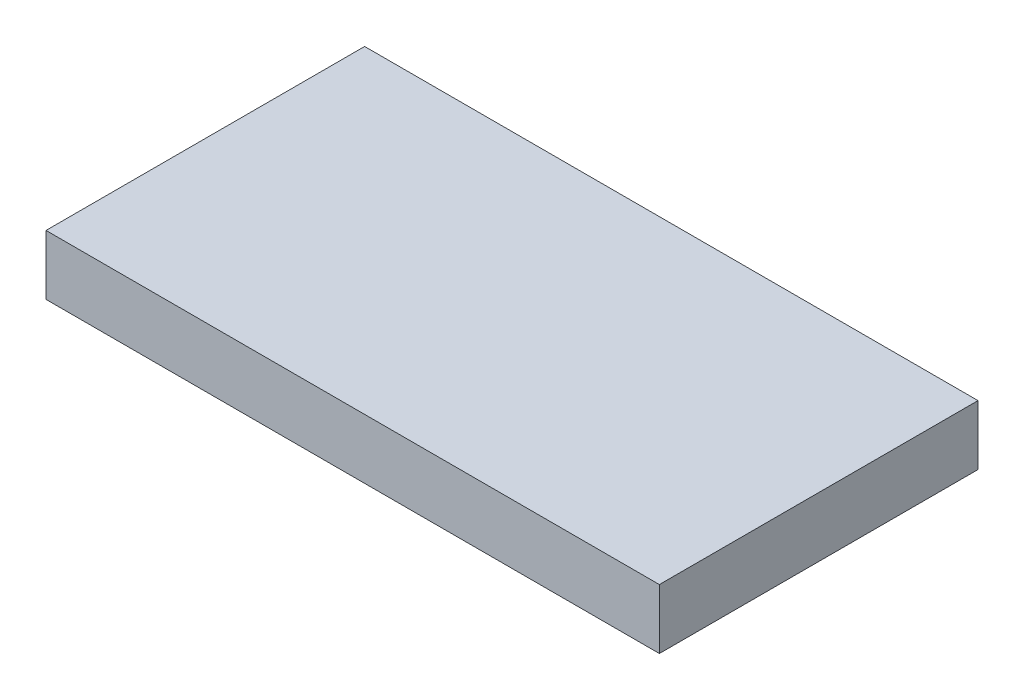
ISO-10303-21;
HEADER;
FILE_DESCRIPTION(('STEP AP214'),'2;1');
FILE_NAME('part.step','',(''),(''),'','','');
FILE_SCHEMA(('AUTOMOTIVE_DESIGN { 1 0 10303 214 1 1 1 1 }'));
ENDSEC;
DATA;
#1=APPLICATION_CONTEXT('core data for automotive mechanical design processes');
#2=APPLICATION_PROTOCOL_DEFINITION('international standard','automotive_design',2000,#1);
#3=PRODUCT_CONTEXT('',#1,'mechanical');
#4=PRODUCT('Part','Part','',(#3));
#5=PRODUCT_RELATED_PRODUCT_CATEGORY('part','',(#4));
#6=PRODUCT_DEFINITION_FORMATION('','',#4);
#7=PRODUCT_DEFINITION_CONTEXT('part definition',#1,'design');
#8=PRODUCT_DEFINITION('design','',#6,#7);
#9=PRODUCT_DEFINITION_SHAPE('','',#8);
#10=(LENGTH_UNIT() NAMED_UNIT(*) SI_UNIT(.MILLI.,.METRE.));
#11=(NAMED_UNIT(*) PLANE_ANGLE_UNIT() SI_UNIT($,.RADIAN.));
#12=(NAMED_UNIT(*) SI_UNIT($,.STERADIAN.) SOLID_ANGLE_UNIT());
#13=UNCERTAINTY_MEASURE_WITH_UNIT(LENGTH_MEASURE(1.E-05),#10,'distance_accuracy_value','');
#14=(GEOMETRIC_REPRESENTATION_CONTEXT(3) GLOBAL_UNCERTAINTY_ASSIGNED_CONTEXT((#13)) GLOBAL_UNIT_ASSIGNED_CONTEXT((#10,
#11,#12)) REPRESENTATION_CONTEXT('',''));
#15=CARTESIAN_POINT('',(0.,0.,0.));
#16=DIRECTION('',(0.,0.,1.));
#17=DIRECTION('',(1.,0.,0.));
#18=AXIS2_PLACEMENT_3D('',#15,#16,#17);
#19=CARTESIAN_POINT('',(0.77,0.15,0.4));
#20=DIRECTION('',(-1.,0.,0.));
#21=DIRECTION('',(0.,0.,1.));
#22=AXIS2_PLACEMENT_3D('',#19,#20,#21);
#23=PLANE('',#22);
#24=DIRECTION('',(0.,0.,-1.));
#25=VECTOR('',#24,1.);
#26=CARTESIAN_POINT('',(0.77,0.,0.4));
#27=LINE('',#26,#25);
#28=CARTESIAN_POINT('',(0.77,0.,0.4));
#29=VERTEX_POINT('',#28);
#30=CARTESIAN_POINT('',(0.77,0.,-0.4));
#31=VERTEX_POINT('',#30);
#32=EDGE_CURVE('E95',#29,#31,#27,.T.);
#33=ORIENTED_EDGE('',*,*,#32,.T.);
#34=DIRECTION('',(0.,-1.,0.));
#35=VECTOR('',#34,1.);
#36=CARTESIAN_POINT('',(0.77,0.15,-0.4));
#37=LINE('',#36,#35);
#38=CARTESIAN_POINT('',(0.77,0.15,-0.4));
#39=VERTEX_POINT('',#38);
#40=EDGE_CURVE('E11',#39,#31,#37,.T.);
#41=ORIENTED_EDGE('',*,*,#40,.F.);
#42=DIRECTION('',(0.,0.,-1.));
#43=VECTOR('',#42,1.);
#44=CARTESIAN_POINT('',(0.77,0.15,0.4));
#45=LINE('',#44,#43);
#46=CARTESIAN_POINT('',(0.77,0.15,0.4));
#47=VERTEX_POINT('',#46);
#48=EDGE_CURVE('E83',#47,#39,#45,.T.);
#49=ORIENTED_EDGE('',*,*,#48,.F.);
#50=DIRECTION('',(0.,-1.,0.));
#51=VECTOR('',#50,1.);
#52=CARTESIAN_POINT('',(0.77,0.15,0.4));
#53=LINE('',#52,#51);
#54=EDGE_CURVE('E91',#47,#29,#53,.T.);
#55=ORIENTED_EDGE('',*,*,#54,.T.);
#56=EDGE_LOOP('',(#33,#41,#49,#55));
#57=FACE_BOUND('',#56,.T.);
#58=ADVANCED_FACE('F32',(#57),#23,.F.);
#59=CARTESIAN_POINT('',(-0.77,0.15,-0.4));
#60=DIRECTION('',(0.,0.,1.));
#61=DIRECTION('',(1.,0.,0.));
#62=AXIS2_PLACEMENT_3D('',#59,#60,#61);
#63=PLANE('',#62);
#64=DIRECTION('',(-1.,0.,0.));
#65=VECTOR('',#64,1.);
#66=CARTESIAN_POINT('',(-0.77,0.,-0.4));
#67=LINE('',#66,#65);
#68=CARTESIAN_POINT('',(-0.77,0.,-0.4));
#69=VERTEX_POINT('',#68);
#70=EDGE_CURVE('E87',#31,#69,#67,.T.);
#71=ORIENTED_EDGE('',*,*,#70,.T.);
#72=DIRECTION('',(0.,-1.,0.));
#73=VECTOR('',#72,1.);
#74=CARTESIAN_POINT('',(-0.77,0.15,-0.4));
#75=LINE('',#74,#73);
#76=CARTESIAN_POINT('',(-0.77,0.15,-0.4));
#77=VERTEX_POINT('',#76);
#78=EDGE_CURVE('E40',#77,#69,#75,.T.);
#79=ORIENTED_EDGE('',*,*,#78,.F.);
#80=DIRECTION('',(-1.,0.,0.));
#81=VECTOR('',#80,1.);
#82=CARTESIAN_POINT('',(-0.77,0.15,-0.4));
#83=LINE('',#82,#81);
#84=EDGE_CURVE('E78',#39,#77,#83,.T.);
#85=ORIENTED_EDGE('',*,*,#84,.F.);
#86=ORIENTED_EDGE('',*,*,#40,.T.);
#87=EDGE_LOOP('',(#71,#79,#85,#86));
#88=FACE_BOUND('',#87,.T.);
#89=ADVANCED_FACE('F86',(#88),#63,.F.);
#90=CARTESIAN_POINT('',(-0.77,0.15,0.4));
#91=DIRECTION('',(1.,0.,0.));
#92=DIRECTION('',(0.,0.,-1.));
#93=AXIS2_PLACEMENT_3D('',#90,#91,#92);
#94=PLANE('',#93);
#95=DIRECTION('',(0.,0.,1.));
#96=VECTOR('',#95,1.);
#97=CARTESIAN_POINT('',(-0.77,0.,0.4));
#98=LINE('',#97,#96);
#99=CARTESIAN_POINT('',(-0.77,0.,0.4));
#100=VERTEX_POINT('',#99);
#101=EDGE_CURVE('E65',#69,#100,#98,.T.);
#102=ORIENTED_EDGE('',*,*,#101,.T.);
#103=DIRECTION('',(0.,-1.,0.));
#104=VECTOR('',#103,1.);
#105=CARTESIAN_POINT('',(-0.77,0.15,0.4));
#106=LINE('',#105,#104);
#107=CARTESIAN_POINT('',(-0.77,0.15,0.4));
#108=VERTEX_POINT('',#107);
#109=EDGE_CURVE('E88',#108,#100,#106,.T.);
#110=ORIENTED_EDGE('',*,*,#109,.F.);
#111=DIRECTION('',(0.,0.,1.));
#112=VECTOR('',#111,1.);
#113=CARTESIAN_POINT('',(-0.77,0.15,0.4));
#114=LINE('',#113,#112);
#115=EDGE_CURVE('E81',#77,#108,#114,.T.);
#116=ORIENTED_EDGE('',*,*,#115,.F.);
#117=ORIENTED_EDGE('',*,*,#78,.T.);
#118=EDGE_LOOP('',(#102,#110,#116,#117));
#119=FACE_BOUND('',#118,.T.);
#120=ADVANCED_FACE('F89',(#119),#94,.F.);
#121=CARTESIAN_POINT('',(-0.77,0.15,0.4));
#122=DIRECTION('',(0.,0.,-1.));
#123=DIRECTION('',(-1.,0.,0.));
#124=AXIS2_PLACEMENT_3D('',#121,#122,#123);
#125=PLANE('',#124);
#126=DIRECTION('',(1.,0.,0.));
#127=VECTOR('',#126,1.);
#128=CARTESIAN_POINT('',(-0.77,0.,0.4));
#129=LINE('',#128,#127);
#130=EDGE_CURVE('E71',#100,#29,#129,.T.);
#131=ORIENTED_EDGE('',*,*,#130,.T.);
#132=ORIENTED_EDGE('',*,*,#54,.F.);
#133=DIRECTION('',(1.,0.,0.));
#134=VECTOR('',#133,1.);
#135=CARTESIAN_POINT('',(-0.77,0.15,0.4));
#136=LINE('',#135,#134);
#137=EDGE_CURVE('E48',#108,#47,#136,.T.);
#138=ORIENTED_EDGE('',*,*,#137,.F.);
#139=ORIENTED_EDGE('',*,*,#109,.T.);
#140=EDGE_LOOP('',(#131,#132,#138,#139));
#141=FACE_BOUND('',#140,.T.);
#142=ADVANCED_FACE('F102',(#141),#125,.F.);
#143=CARTESIAN_POINT('',(0.,0.15,0.));
#144=DIRECTION('',(0.,-1.,0.));
#145=DIRECTION('',(0.,0.,-1.));
#146=AXIS2_PLACEMENT_3D('',#143,#144,#145);
#147=PLANE('',#146);
#148=ORIENTED_EDGE('',*,*,#48,.T.);
#149=ORIENTED_EDGE('',*,*,#84,.T.);
#150=ORIENTED_EDGE('',*,*,#115,.T.);
#151=ORIENTED_EDGE('',*,*,#137,.T.);
#152=EDGE_LOOP('',(#148,#149,#150,#151));
#153=FACE_BOUND('',#152,.T.);
#154=ADVANCED_FACE('F79',(#153),#147,.F.);
#155=CARTESIAN_POINT('',(0.,0.,0.));
#156=DIRECTION('',(0.,-1.,0.));
#157=DIRECTION('',(0.,0.,-1.));
#158=AXIS2_PLACEMENT_3D('',#155,#156,#157);
#159=PLANE('',#158);
#160=ORIENTED_EDGE('',*,*,#32,.F.);
#161=ORIENTED_EDGE('',*,*,#130,.F.);
#162=ORIENTED_EDGE('',*,*,#101,.F.);
#163=ORIENTED_EDGE('',*,*,#70,.F.);
#164=EDGE_LOOP('',(#160,#161,#162,#163));
#165=FACE_BOUND('',#164,.T.);
#166=ADVANCED_FACE('F105',(#165),#159,.T.);
#167=CLOSED_SHELL('',(#58,#89,#120,#142,#154,#166));
#168=MANIFOLD_SOLID_BREP('B2',#167);
#169=ADVANCED_BREP_SHAPE_REPRESENTATION('',(#18,#168),#14);
#170=SHAPE_DEFINITION_REPRESENTATION(#9,#169);
ENDSEC;
END-ISO-10303-21;
